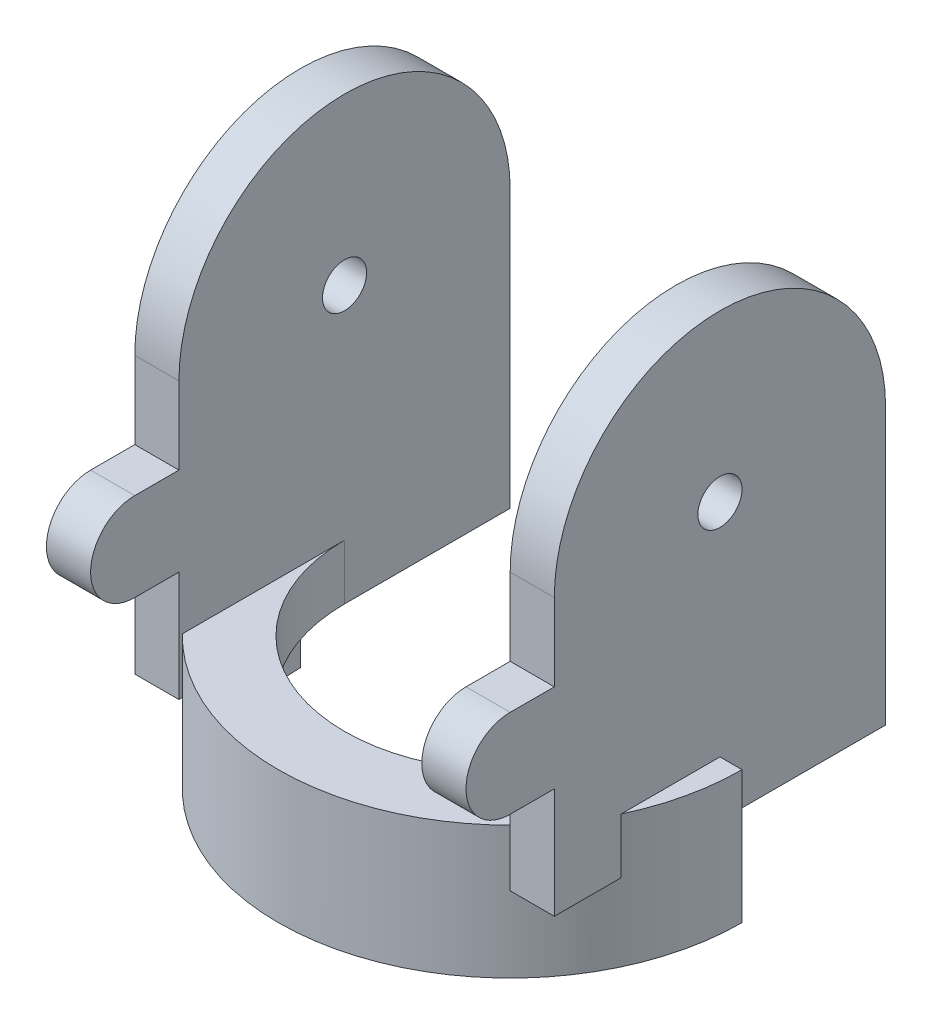
ISO-10303-21;
HEADER;
FILE_DESCRIPTION(('STEP AP214'),'2;1');
FILE_NAME('part.step','',(''),(''),'','','');
FILE_SCHEMA(('AUTOMOTIVE_DESIGN { 1 0 10303 214 1 1 1 1 }'));
ENDSEC;
DATA;
#1=APPLICATION_CONTEXT('core data for automotive mechanical design processes');
#2=APPLICATION_PROTOCOL_DEFINITION('international standard','automotive_design',2000,#1);
#3=PRODUCT_CONTEXT('',#1,'mechanical');
#4=PRODUCT('Part','Part','',(#3));
#5=PRODUCT_RELATED_PRODUCT_CATEGORY('part','',(#4));
#6=PRODUCT_DEFINITION_FORMATION('','',#4);
#7=PRODUCT_DEFINITION_CONTEXT('part definition',#1,'design');
#8=PRODUCT_DEFINITION('design','',#6,#7);
#9=PRODUCT_DEFINITION_SHAPE('','',#8);
#10=(LENGTH_UNIT() NAMED_UNIT(*) SI_UNIT(.MILLI.,.METRE.));
#11=(NAMED_UNIT(*) PLANE_ANGLE_UNIT() SI_UNIT($,.RADIAN.));
#12=(NAMED_UNIT(*) SI_UNIT($,.STERADIAN.) SOLID_ANGLE_UNIT());
#13=UNCERTAINTY_MEASURE_WITH_UNIT(LENGTH_MEASURE(1.E-05),#10,'distance_accuracy_value','');
#14=(GEOMETRIC_REPRESENTATION_CONTEXT(3) GLOBAL_UNCERTAINTY_ASSIGNED_CONTEXT((#13)) GLOBAL_UNIT_ASSIGNED_CONTEXT((#10,
#11,#12)) REPRESENTATION_CONTEXT('',''));
#15=CARTESIAN_POINT('',(0.,0.,0.));
#16=DIRECTION('',(0.,0.,1.));
#17=DIRECTION('',(1.,0.,0.));
#18=AXIS2_PLACEMENT_3D('',#15,#16,#17);
#19=CARTESIAN_POINT('',(-30.,36.,46.));
#20=DIRECTION('',(0.,-1.,0.));
#21=DIRECTION('',(0.,0.,-1.));
#22=AXIS2_PLACEMENT_3D('',#19,#20,#21);
#23=PLANE('',#22);
#24=DIRECTION('',(1.,0.,0.));
#25=VECTOR('',#24,1.);
#26=CARTESIAN_POINT('',(-42.,36.,38.));
#27=LINE('',#26,#25);
#28=CARTESIAN_POINT('',(-38.,36.,38.));
#29=VERTEX_POINT('',#28);
#30=CARTESIAN_POINT('',(-30.,36.,38.));
#31=VERTEX_POINT('',#30);
#32=EDGE_CURVE('E231',#29,#31,#27,.T.);
#33=ORIENTED_EDGE('',*,*,#32,.T.);
#34=DIRECTION('',(0.,0.,-1.));
#35=VECTOR('',#34,1.);
#36=CARTESIAN_POINT('',(-30.,36.,46.));
#37=LINE('',#36,#35);
#38=CARTESIAN_POINT('',(-30.,36.,30.));
#39=VERTEX_POINT('',#38);
#40=EDGE_CURVE('E256',#31,#39,#37,.T.);
#41=ORIENTED_EDGE('',*,*,#40,.T.);
#42=DIRECTION('',(-1.,0.,0.));
#43=VECTOR('',#42,1.);
#44=CARTESIAN_POINT('',(-30.,36.,30.));
#45=LINE('',#44,#43);
#46=CARTESIAN_POINT('',(-38.,36.,30.));
#47=VERTEX_POINT('',#46);
#48=EDGE_CURVE('E239',#39,#47,#45,.T.);
#49=ORIENTED_EDGE('',*,*,#48,.T.);
#50=DIRECTION('',(0.,0.,-1.));
#51=VECTOR('',#50,1.);
#52=CARTESIAN_POINT('',(-38.,36.,46.));
#53=LINE('',#52,#51);
#54=EDGE_CURVE('E254',#29,#47,#53,.T.);
#55=ORIENTED_EDGE('',*,*,#54,.F.);
#56=EDGE_LOOP('',(#33,#41,#49,#55));
#57=FACE_BOUND('',#56,.T.);
#58=ADVANCED_FACE('F38',(#57),#23,.F.);
#59=CARTESIAN_POINT('',(38.,36.,46.));
#60=DIRECTION('',(0.,-1.,0.));
#61=DIRECTION('',(0.,0.,-1.));
#62=AXIS2_PLACEMENT_3D('',#59,#60,#61);
#63=PLANE('',#62);
#64=CARTESIAN_POINT('',(30.,36.,38.));
#65=VERTEX_POINT('',#64);
#66=CARTESIAN_POINT('',(38.,36.,38.));
#67=VERTEX_POINT('',#66);
#68=EDGE_CURVE('E218',#65,#67,#27,.T.);
#69=ORIENTED_EDGE('',*,*,#68,.T.);
#70=DIRECTION('',(0.,0.,-1.));
#71=VECTOR('',#70,1.);
#72=CARTESIAN_POINT('',(38.,36.,46.));
#73=LINE('',#72,#71);
#74=CARTESIAN_POINT('',(38.,36.,30.));
#75=VERTEX_POINT('',#74);
#76=EDGE_CURVE('E228',#67,#75,#73,.T.);
#77=ORIENTED_EDGE('',*,*,#76,.T.);
#78=DIRECTION('',(-1.,0.,0.));
#79=VECTOR('',#78,1.);
#80=CARTESIAN_POINT('',(38.,36.,30.));
#81=LINE('',#80,#79);
#82=CARTESIAN_POINT('',(30.,36.,30.));
#83=VERTEX_POINT('',#82);
#84=EDGE_CURVE('E515',#75,#83,#81,.T.);
#85=ORIENTED_EDGE('',*,*,#84,.T.);
#86=DIRECTION('',(0.,0.,-1.));
#87=VECTOR('',#86,1.);
#88=CARTESIAN_POINT('',(30.,36.,46.));
#89=LINE('',#88,#87);
#90=EDGE_CURVE('E230',#65,#83,#89,.T.);
#91=ORIENTED_EDGE('',*,*,#90,.F.);
#92=EDGE_LOOP('',(#69,#77,#85,#91));
#93=FACE_BOUND('',#92,.T.);
#94=ADVANCED_FACE('F226',(#93),#63,.F.);
#95=CARTESIAN_POINT('',(38.,80.,30.));
#96=DIRECTION('',(0.,0.,1.));
#97=DIRECTION('',(1.,0.,0.));
#98=AXIS2_PLACEMENT_3D('',#95,#96,#97);
#99=PLANE('',#98);
#100=DIRECTION('',(0.,-1.,0.));
#101=VECTOR('',#100,1.);
#102=CARTESIAN_POINT('',(30.,80.,30.));
#103=LINE('',#102,#101);
#104=CARTESIAN_POINT('',(30.,50.,30.));
#105=VERTEX_POINT('',#104);
#106=EDGE_CURVE('E361',#105,#83,#103,.T.);
#107=ORIENTED_EDGE('',*,*,#106,.T.);
#108=ORIENTED_EDGE('',*,*,#84,.F.);
#109=DIRECTION('',(0.,-1.,0.));
#110=VECTOR('',#109,1.);
#111=CARTESIAN_POINT('',(38.,80.,30.));
#112=LINE('',#111,#110);
#113=CARTESIAN_POINT('',(38.,50.,30.));
#114=VERTEX_POINT('',#113);
#115=EDGE_CURVE('E238',#114,#75,#112,.T.);
#116=ORIENTED_EDGE('',*,*,#115,.F.);
#117=DIRECTION('',(1.,0.,0.));
#118=VECTOR('',#117,1.);
#119=CARTESIAN_POINT('',(-42.,50.,30.));
#120=LINE('',#119,#118);
#121=EDGE_CURVE('E317',#105,#114,#120,.T.);
#122=ORIENTED_EDGE('',*,*,#121,.F.);
#123=EDGE_LOOP('',(#107,#108,#116,#122));
#124=FACE_BOUND('',#123,.T.);
#125=ADVANCED_FACE('F532',(#124),#99,.T.);
#126=CARTESIAN_POINT('',(38.,20.,30.));
#127=VERTEX_POINT('',#126);
#128=CARTESIAN_POINT('',(38.,0.,30.));
#129=VERTEX_POINT('',#128);
#130=EDGE_CURVE('E355',#127,#129,#112,.T.);
#131=ORIENTED_EDGE('',*,*,#130,.F.);
#132=DIRECTION('',(1.,0.,0.));
#133=VECTOR('',#132,1.);
#134=CARTESIAN_POINT('',(38.,20.,30.));
#135=LINE('',#134,#133);
#136=CARTESIAN_POINT('',(30.,20.,30.));
#137=VERTEX_POINT('',#136);
#138=EDGE_CURVE('E509',#137,#127,#135,.T.);
#139=ORIENTED_EDGE('',*,*,#138,.F.);
#140=CARTESIAN_POINT('',(30.,0.,30.));
#141=VERTEX_POINT('',#140);
#142=EDGE_CURVE('E364',#137,#141,#103,.T.);
#143=ORIENTED_EDGE('',*,*,#142,.T.);
#144=DIRECTION('',(-1.,0.,0.));
#145=VECTOR('',#144,1.);
#146=CARTESIAN_POINT('',(38.,0.,30.));
#147=LINE('',#146,#145);
#148=EDGE_CURVE('E345',#129,#141,#147,.T.);
#149=ORIENTED_EDGE('',*,*,#148,.F.);
#150=EDGE_LOOP('',(#131,#139,#143,#149));
#151=FACE_BOUND('',#150,.T.);
#152=ADVANCED_FACE('F506',(#151),#99,.T.);
#153=CARTESIAN_POINT('',(-38.,80.,30.));
#154=DIRECTION('',(0.,0.,1.));
#155=DIRECTION('',(1.,0.,0.));
#156=AXIS2_PLACEMENT_3D('',#153,#154,#155);
#157=PLANE('',#156);
#158=DIRECTION('',(0.,-1.,0.));
#159=VECTOR('',#158,1.);
#160=CARTESIAN_POINT('',(-38.,80.,30.));
#161=LINE('',#160,#159);
#162=CARTESIAN_POINT('',(-38.,50.,30.));
#163=VERTEX_POINT('',#162);
#164=EDGE_CURVE('E381',#163,#47,#161,.T.);
#165=ORIENTED_EDGE('',*,*,#164,.T.);
#166=ORIENTED_EDGE('',*,*,#48,.F.);
#167=DIRECTION('',(0.,-1.,0.));
#168=VECTOR('',#167,1.);
#169=CARTESIAN_POINT('',(-30.,80.,30.));
#170=LINE('',#169,#168);
#171=CARTESIAN_POINT('',(-30.,50.,30.));
#172=VERTEX_POINT('',#171);
#173=EDGE_CURVE('E386',#172,#39,#170,.T.);
#174=ORIENTED_EDGE('',*,*,#173,.F.);
#175=EDGE_CURVE('E319',#163,#172,#120,.T.);
#176=ORIENTED_EDGE('',*,*,#175,.F.);
#177=EDGE_LOOP('',(#165,#166,#174,#176));
#178=FACE_BOUND('',#177,.T.);
#179=ADVANCED_FACE('F473',(#178),#157,.T.);
#180=CARTESIAN_POINT('',(-30.,20.,30.));
#181=VERTEX_POINT('',#180);
#182=CARTESIAN_POINT('',(-30.,0.,30.));
#183=VERTEX_POINT('',#182);
#184=EDGE_CURVE('E389',#181,#183,#170,.T.);
#185=ORIENTED_EDGE('',*,*,#184,.F.);
#186=DIRECTION('',(1.,0.,0.));
#187=VECTOR('',#186,1.);
#188=CARTESIAN_POINT('',(-30.,20.,30.));
#189=LINE('',#188,#187);
#190=CARTESIAN_POINT('',(-38.,20.,30.));
#191=VERTEX_POINT('',#190);
#192=EDGE_CURVE('E242',#191,#181,#189,.T.);
#193=ORIENTED_EDGE('',*,*,#192,.F.);
#194=CARTESIAN_POINT('',(-38.,0.,30.));
#195=VERTEX_POINT('',#194);
#196=EDGE_CURVE('E385',#191,#195,#161,.T.);
#197=ORIENTED_EDGE('',*,*,#196,.T.);
#198=DIRECTION('',(-1.,0.,0.));
#199=VECTOR('',#198,1.);
#200=CARTESIAN_POINT('',(-38.,0.,30.));
#201=LINE('',#200,#199);
#202=EDGE_CURVE('E377',#183,#195,#201,.T.);
#203=ORIENTED_EDGE('',*,*,#202,.F.);
#204=EDGE_LOOP('',(#185,#193,#197,#203));
#205=FACE_BOUND('',#204,.T.);
#206=ADVANCED_FACE('F458',(#205),#157,.T.);
#207=CARTESIAN_POINT('',(0.,0.,0.));
#208=DIRECTION('',(0.,1.,0.));
#209=DIRECTION('',(0.,0.,1.));
#210=AXIS2_PLACEMENT_3D('',#207,#208,#209);
#211=PLANE('',#210);
#212=DIRECTION('',(0.,0.,-1.));
#213=VECTOR('',#212,1.);
#214=CARTESIAN_POINT('',(-38.,0.,30.));
#215=LINE('',#214,#213);
#216=CARTESIAN_POINT('',(-38.,0.,17.8885438199983));
#217=VERTEX_POINT('',#216);
#218=EDGE_CURVE('E368',#195,#217,#215,.T.);
#219=ORIENTED_EDGE('',*,*,#218,.T.);
#220=CARTESIAN_POINT('',(0.,0.,0.));
#221=DIRECTION('',(0.,1.,0.));
#222=DIRECTION('',(0.,0.,1.));
#223=AXIS2_PLACEMENT_3D('',#220,#221,#222);
#224=CIRCLE('',#223,42.);
#225=CARTESIAN_POINT('',(-30.,0.,29.3938769133981));
#226=VERTEX_POINT('',#225);
#227=EDGE_CURVE('E299',#217,#226,#224,.T.);
#228=ORIENTED_EDGE('',*,*,#227,.T.);
#229=DIRECTION('',(0.,0.,1.));
#230=VECTOR('',#229,1.);
#231=CARTESIAN_POINT('',(-30.,0.,30.));
#232=LINE('',#231,#230);
#233=EDGE_CURVE('E374',#226,#183,#232,.T.);
#234=ORIENTED_EDGE('',*,*,#233,.T.);
#235=ORIENTED_EDGE('',*,*,#202,.T.);
#236=EDGE_LOOP('',(#219,#228,#234,#235));
#237=FACE_BOUND('',#236,.T.);
#238=ADVANCED_FACE('F448',(#237),#211,.F.);
#239=DIRECTION('',(0.,0.,-1.));
#240=VECTOR('',#239,1.);
#241=CARTESIAN_POINT('',(30.,0.,30.));
#242=LINE('',#241,#240);
#243=CARTESIAN_POINT('',(30.,0.,29.3938769133982));
#244=VERTEX_POINT('',#243);
#245=EDGE_CURVE('E349',#141,#244,#242,.T.);
#246=ORIENTED_EDGE('',*,*,#245,.T.);
#247=CARTESIAN_POINT('',(38.,0.,17.8885438199984));
#248=VERTEX_POINT('',#247);
#249=EDGE_CURVE('E296',#244,#248,#224,.T.);
#250=ORIENTED_EDGE('',*,*,#249,.T.);
#251=DIRECTION('',(0.,0.,1.));
#252=VECTOR('',#251,1.);
#253=CARTESIAN_POINT('',(38.,0.,30.));
#254=LINE('',#253,#252);
#255=EDGE_CURVE('E341',#248,#129,#254,.T.);
#256=ORIENTED_EDGE('',*,*,#255,.T.);
#257=ORIENTED_EDGE('',*,*,#148,.T.);
#258=EDGE_LOOP('',(#246,#250,#256,#257));
#259=FACE_BOUND('',#258,.T.);
#260=ADVANCED_FACE('F500',(#259),#211,.F.);
#261=CARTESIAN_POINT('',(0.,10.,0.));
#262=DIRECTION('',(0.,1.,0.));
#263=DIRECTION('',(0.,0.,1.));
#264=AXIS2_PLACEMENT_3D('',#261,#262,#263);
#265=PLANE('',#264);
#266=DIRECTION('',(0.,0.,1.));
#267=VECTOR('',#266,1.);
#268=CARTESIAN_POINT('',(30.,10.,0.));
#269=LINE('',#268,#267);
#270=CARTESIAN_POINT('',(30.,9.99999999999999,0.));
#271=VERTEX_POINT('',#270);
#272=CARTESIAN_POINT('',(30.,10.,29.3938769133982));
#273=VERTEX_POINT('',#272);
#274=EDGE_CURVE('E358',#271,#273,#269,.T.);
#275=ORIENTED_EDGE('',*,*,#274,.F.);
#276=CARTESIAN_POINT('',(0.,10.,0.));
#277=DIRECTION('',(0.,1.,0.));
#278=DIRECTION('',(0.,0.,1.));
#279=AXIS2_PLACEMENT_3D('',#276,#277,#278);
#280=CIRCLE('',#279,30.);
#281=CARTESIAN_POINT('',(-30.,10.,0.));
#282=VERTEX_POINT('',#281);
#283=EDGE_CURVE('E397',#282,#271,#280,.T.);
#284=ORIENTED_EDGE('',*,*,#283,.F.);
#285=DIRECTION('',(0.,0.,-1.));
#286=VECTOR('',#285,1.);
#287=CARTESIAN_POINT('',(-30.,10.,0.));
#288=LINE('',#287,#286);
#289=CARTESIAN_POINT('',(-30.,10.,29.3938769133981));
#290=VERTEX_POINT('',#289);
#291=EDGE_CURVE('E384',#290,#282,#288,.T.);
#292=ORIENTED_EDGE('',*,*,#291,.F.);
#293=CARTESIAN_POINT('',(0.,10.,0.));
#294=DIRECTION('',(0.,1.,0.));
#295=DIRECTION('',(0.,0.,1.));
#296=AXIS2_PLACEMENT_3D('',#293,#294,#295);
#297=CIRCLE('',#296,42.);
#298=EDGE_CURVE('E277',#290,#273,#297,.T.);
#299=ORIENTED_EDGE('',*,*,#298,.T.);
#300=EDGE_LOOP('',(#275,#284,#292,#299));
#301=FACE_BOUND('',#300,.T.);
#302=ADVANCED_FACE('F495',(#301),#265,.T.);
#303=CARTESIAN_POINT('',(0.,0.,0.));
#304=DIRECTION('',(0.,1.,0.));
#305=DIRECTION('',(0.,0.,1.));
#306=AXIS2_PLACEMENT_3D('',#303,#304,#305);
#307=CIRCLE('',#306,38.);
#308=CARTESIAN_POINT('',(-38.,0.,0.));
#309=VERTEX_POINT('',#308);
#310=CARTESIAN_POINT('',(38.,0.,0.));
#311=VERTEX_POINT('',#310);
#312=EDGE_CURVE('E400',#309,#311,#307,.T.);
#313=ORIENTED_EDGE('',*,*,#312,.F.);
#314=CARTESIAN_POINT('',(-38.,0.,-30.));
#315=VERTEX_POINT('',#314);
#316=EDGE_CURVE('E367',#309,#315,#215,.T.);
#317=ORIENTED_EDGE('',*,*,#316,.T.);
#318=DIRECTION('',(1.,0.,0.));
#319=VECTOR('',#318,1.);
#320=CARTESIAN_POINT('',(-38.,0.,-30.));
#321=LINE('',#320,#319);
#322=CARTESIAN_POINT('',(-30.,0.,-30.));
#323=VERTEX_POINT('',#322);
#324=EDGE_CURVE('E371',#315,#323,#321,.T.);
#325=ORIENTED_EDGE('',*,*,#324,.T.);
#326=CARTESIAN_POINT('',(-30.,0.,0.));
#327=VERTEX_POINT('',#326);
#328=EDGE_CURVE('E375',#323,#327,#232,.T.);
#329=ORIENTED_EDGE('',*,*,#328,.T.);
#330=CARTESIAN_POINT('',(0.,0.,0.));
#331=DIRECTION('',(0.,1.,0.));
#332=DIRECTION('',(0.,0.,1.));
#333=AXIS2_PLACEMENT_3D('',#330,#331,#332);
#334=CIRCLE('',#333,30.);
#335=CARTESIAN_POINT('',(30.,0.,0.));
#336=VERTEX_POINT('',#335);
#337=EDGE_CURVE('E396',#327,#336,#334,.T.);
#338=ORIENTED_EDGE('',*,*,#337,.T.);
#339=CARTESIAN_POINT('',(30.,0.,-30.));
#340=VERTEX_POINT('',#339);
#341=EDGE_CURVE('E348',#336,#340,#242,.T.);
#342=ORIENTED_EDGE('',*,*,#341,.T.);
#343=DIRECTION('',(1.,0.,0.));
#344=VECTOR('',#343,1.);
#345=CARTESIAN_POINT('',(38.,0.,-30.));
#346=LINE('',#345,#344);
#347=CARTESIAN_POINT('',(38.,0.,-30.));
#348=VERTEX_POINT('',#347);
#349=EDGE_CURVE('E352',#340,#348,#346,.T.);
#350=ORIENTED_EDGE('',*,*,#349,.T.);
#351=EDGE_CURVE('E342',#348,#311,#254,.T.);
#352=ORIENTED_EDGE('',*,*,#351,.T.);
#353=EDGE_LOOP('',(#313,#317,#325,#329,#338,#342,#350,#352));
#354=FACE_BOUND('',#353,.T.);
#355=ADVANCED_FACE('F40',(#354),#211,.F.);
#356=CARTESIAN_POINT('',(0.,10.,0.));
#357=DIRECTION('',(0.,-1.,0.));
#358=DIRECTION('',(0.,0.,-1.));
#359=AXIS2_PLACEMENT_3D('',#356,#357,#358);
#360=CYLINDRICAL_SURFACE('',#359,30.);
#361=DIRECTION('',(0.,-1.,0.));
#362=VECTOR('',#361,1.);
#363=CARTESIAN_POINT('',(-30.,80.,0.));
#364=LINE('',#363,#362);
#365=EDGE_CURVE('E309',#282,#327,#364,.T.);
#366=ORIENTED_EDGE('',*,*,#365,.F.);
#367=ORIENTED_EDGE('',*,*,#283,.T.);
#368=DIRECTION('',(0.,-1.,0.));
#369=VECTOR('',#368,1.);
#370=CARTESIAN_POINT('',(30.,80.,0.));
#371=LINE('',#370,#369);
#372=EDGE_CURVE('E308',#271,#336,#371,.T.);
#373=ORIENTED_EDGE('',*,*,#372,.T.);
#374=ORIENTED_EDGE('',*,*,#337,.F.);
#375=EDGE_LOOP('',(#366,#367,#373,#374));
#376=FACE_BOUND('',#375,.T.);
#377=ADVANCED_FACE('F487',(#376),#360,.F.);
#378=CARTESIAN_POINT('',(-30.,80.,30.));
#379=DIRECTION('',(1.,0.,0.));
#380=DIRECTION('',(0.,0.,-1.));
#381=AXIS2_PLACEMENT_3D('',#378,#379,#380);
#382=PLANE('',#381);
#383=CARTESIAN_POINT('',(-30.,28.,38.));
#384=DIRECTION('',(1.,0.,0.));
#385=DIRECTION('',(0.,0.,-1.));
#386=AXIS2_PLACEMENT_3D('',#383,#384,#385);
#387=CIRCLE('',#386,8.);
#388=CARTESIAN_POINT('',(-30.,20.,38.));
#389=VERTEX_POINT('',#388);
#390=EDGE_CURVE('E465',#389,#31,#387,.F.);
#391=ORIENTED_EDGE('',*,*,#390,.F.);
#392=DIRECTION('',(0.,0.,-1.));
#393=VECTOR('',#392,1.);
#394=CARTESIAN_POINT('',(-30.,20.,46.));
#395=LINE('',#394,#393);
#396=EDGE_CURVE('E250',#389,#181,#395,.T.);
#397=ORIENTED_EDGE('',*,*,#396,.T.);
#398=ORIENTED_EDGE('',*,*,#184,.T.);
#399=ORIENTED_EDGE('',*,*,#233,.F.);
#400=DIRECTION('',(0.,1.,0.));
#401=VECTOR('',#400,1.);
#402=CARTESIAN_POINT('',(-30.,-14.,29.3938769133981));
#403=LINE('',#402,#401);
#404=EDGE_CURVE('E305',#290,#226,#403,.F.);
#405=ORIENTED_EDGE('',*,*,#404,.F.);
#406=ORIENTED_EDGE('',*,*,#291,.T.);
#407=ORIENTED_EDGE('',*,*,#365,.T.);
#408=ORIENTED_EDGE('',*,*,#328,.F.);
#409=DIRECTION('',(0.,-1.,0.));
#410=VECTOR('',#409,1.);
#411=CARTESIAN_POINT('',(-30.,80.,-30.));
#412=LINE('',#411,#410);
#413=CARTESIAN_POINT('',(-30.,50.,-30.));
#414=VERTEX_POINT('',#413);
#415=EDGE_CURVE('E390',#414,#323,#412,.T.);
#416=ORIENTED_EDGE('',*,*,#415,.F.);
#417=CARTESIAN_POINT('',(-30.,50.,0.));
#418=DIRECTION('',(1.,0.,0.));
#419=DIRECTION('',(0.,0.,-1.));
#420=AXIS2_PLACEMENT_3D('',#417,#418,#419);
#421=CIRCLE('',#420,30.);
#422=EDGE_CURVE('E330',#172,#414,#421,.F.);
#423=ORIENTED_EDGE('',*,*,#422,.F.);
#424=ORIENTED_EDGE('',*,*,#173,.T.);
#425=ORIENTED_EDGE('',*,*,#40,.F.);
#426=EDGE_LOOP('',(#391,#397,#398,#399,#405,#406,#407,#408,#416,#423,#424,#425));
#427=FACE_BOUND('',#426,.T.);
#428=CARTESIAN_POINT('',(-30.,50.,0.));
#429=DIRECTION('',(1.,0.,0.));
#430=DIRECTION('',(0.,0.,-1.));
#431=AXIS2_PLACEMENT_3D('',#428,#429,#430);
#432=CIRCLE('',#431,4.);
#433=CARTESIAN_POINT('',(-30.,50.,-4.00000000000002));
#434=VERTEX_POINT('',#433);
#435=EDGE_CURVE('E338',#434,#434,#432,.T.);
#436=ORIENTED_EDGE('',*,*,#435,.F.);
#437=EDGE_LOOP('',(#436));
#438=FACE_BOUND('',#437,.T.);
#439=ADVANCED_FACE('F452',(#427,#438),#382,.T.);
#440=CARTESIAN_POINT('',(-38.,80.,30.));
#441=DIRECTION('',(-1.,0.,0.));
#442=DIRECTION('',(0.,0.,1.));
#443=AXIS2_PLACEMENT_3D('',#440,#441,#442);
#444=PLANE('',#443);
#445=DIRECTION('',(0.,0.,-1.));
#446=VECTOR('',#445,1.);
#447=CARTESIAN_POINT('',(-38.,20.,46.));
#448=LINE('',#447,#446);
#449=CARTESIAN_POINT('',(-38.,20.,38.));
#450=VERTEX_POINT('',#449);
#451=EDGE_CURVE('E252',#450,#191,#448,.T.);
#452=ORIENTED_EDGE('',*,*,#451,.F.);
#453=CARTESIAN_POINT('',(-38.,28.,38.));
#454=DIRECTION('',(-1.,0.,0.));
#455=DIRECTION('',(0.,0.,1.));
#456=AXIS2_PLACEMENT_3D('',#453,#454,#455);
#457=CIRCLE('',#456,8.);
#458=EDGE_CURVE('E53',#29,#450,#457,.F.);
#459=ORIENTED_EDGE('',*,*,#458,.F.);
#460=ORIENTED_EDGE('',*,*,#54,.T.);
#461=ORIENTED_EDGE('',*,*,#164,.F.);
#462=CARTESIAN_POINT('',(-38.,50.,0.));
#463=DIRECTION('',(-1.,0.,0.));
#464=DIRECTION('',(0.,0.,1.));
#465=AXIS2_PLACEMENT_3D('',#462,#463,#464);
#466=CIRCLE('',#465,30.);
#467=CARTESIAN_POINT('',(-38.,50.,-30.));
#468=VERTEX_POINT('',#467);
#469=EDGE_CURVE('E328',#468,#163,#466,.F.);
#470=ORIENTED_EDGE('',*,*,#469,.F.);
#471=DIRECTION('',(0.,-1.,0.));
#472=VECTOR('',#471,1.);
#473=CARTESIAN_POINT('',(-38.,80.,-30.));
#474=LINE('',#473,#472);
#475=EDGE_CURVE('E380',#468,#315,#474,.T.);
#476=ORIENTED_EDGE('',*,*,#475,.T.);
#477=ORIENTED_EDGE('',*,*,#316,.F.);
#478=DIRECTION('',(0.,1.,0.));
#479=VECTOR('',#478,1.);
#480=CARTESIAN_POINT('',(-38.,-14.,0.));
#481=LINE('',#480,#479);
#482=CARTESIAN_POINT('',(-38.,9.99999999999999,0.));
#483=VERTEX_POINT('',#482);
#484=EDGE_CURVE('E288',#309,#483,#481,.T.);
#485=ORIENTED_EDGE('',*,*,#484,.T.);
#486=DIRECTION('',(0.,0.,-1.));
#487=VECTOR('',#486,1.);
#488=CARTESIAN_POINT('',(-38.,9.99999999999999,30.));
#489=LINE('',#488,#487);
#490=CARTESIAN_POINT('',(-38.,10.,17.8885438199983));
#491=VERTEX_POINT('',#490);
#492=EDGE_CURVE('E284',#491,#483,#489,.T.);
#493=ORIENTED_EDGE('',*,*,#492,.F.);
#494=DIRECTION('',(0.,1.,0.));
#495=VECTOR('',#494,1.);
#496=CARTESIAN_POINT('',(-38.,-14.,17.8885438199983));
#497=LINE('',#496,#495);
#498=EDGE_CURVE('E302',#217,#491,#497,.T.);
#499=ORIENTED_EDGE('',*,*,#498,.F.);
#500=ORIENTED_EDGE('',*,*,#218,.F.);
#501=ORIENTED_EDGE('',*,*,#196,.F.);
#502=EDGE_LOOP('',(#452,#459,#460,#461,#470,#476,#477,#485,#493,#499,#500,#501));
#503=FACE_BOUND('',#502,.T.);
#504=CARTESIAN_POINT('',(-38.,50.,0.));
#505=DIRECTION('',(-1.,0.,0.));
#506=DIRECTION('',(0.,0.,1.));
#507=AXIS2_PLACEMENT_3D('',#504,#505,#506);
#508=CIRCLE('',#507,4.);
#509=CARTESIAN_POINT('',(-38.,50.,3.99999999999998));
#510=VERTEX_POINT('',#509);
#511=EDGE_CURVE('E335',#510,#510,#508,.T.);
#512=ORIENTED_EDGE('',*,*,#511,.F.);
#513=EDGE_LOOP('',(#512));
#514=FACE_BOUND('',#513,.T.);
#515=ADVANCED_FACE('F431',(#503,#514),#444,.T.);
#516=CARTESIAN_POINT('',(-38.,80.,-30.));
#517=DIRECTION('',(0.,0.,-1.));
#518=DIRECTION('',(-1.,0.,0.));
#519=AXIS2_PLACEMENT_3D('',#516,#517,#518);
#520=PLANE('',#519);
#521=DIRECTION('',(1.,0.,0.));
#522=VECTOR('',#521,1.);
#523=CARTESIAN_POINT('',(-42.,50.,-30.));
#524=LINE('',#523,#522);
#525=EDGE_CURVE('E320',#468,#414,#524,.T.);
#526=ORIENTED_EDGE('',*,*,#525,.T.);
#527=ORIENTED_EDGE('',*,*,#415,.T.);
#528=ORIENTED_EDGE('',*,*,#324,.F.);
#529=ORIENTED_EDGE('',*,*,#475,.F.);
#530=EDGE_LOOP('',(#526,#527,#528,#529));
#531=FACE_BOUND('',#530,.T.);
#532=ADVANCED_FACE('F482',(#531),#520,.T.);
#533=CARTESIAN_POINT('',(30.,80.,30.));
#534=DIRECTION('',(-1.,0.,0.));
#535=DIRECTION('',(0.,0.,1.));
#536=AXIS2_PLACEMENT_3D('',#533,#534,#535);
#537=PLANE('',#536);
#538=DIRECTION('',(0.,0.,-1.));
#539=VECTOR('',#538,1.);
#540=CARTESIAN_POINT('',(30.,20.,46.));
#541=LINE('',#540,#539);
#542=CARTESIAN_POINT('',(30.,20.,38.));
#543=VERTEX_POINT('',#542);
#544=EDGE_CURVE('E244',#543,#137,#541,.T.);
#545=ORIENTED_EDGE('',*,*,#544,.F.);
#546=CARTESIAN_POINT('',(30.,28.,38.));
#547=DIRECTION('',(-1.,0.,0.));
#548=DIRECTION('',(0.,0.,1.));
#549=AXIS2_PLACEMENT_3D('',#546,#547,#548);
#550=CIRCLE('',#549,8.);
#551=EDGE_CURVE('E61',#65,#543,#550,.F.);
#552=ORIENTED_EDGE('',*,*,#551,.F.);
#553=ORIENTED_EDGE('',*,*,#90,.T.);
#554=ORIENTED_EDGE('',*,*,#106,.F.);
#555=CARTESIAN_POINT('',(30.,50.,0.));
#556=DIRECTION('',(-1.,0.,0.));
#557=DIRECTION('',(0.,0.,1.));
#558=AXIS2_PLACEMENT_3D('',#555,#556,#557);
#559=CIRCLE('',#558,30.);
#560=CARTESIAN_POINT('',(30.,50.,-30.));
#561=VERTEX_POINT('',#560);
#562=EDGE_CURVE('E326',#561,#105,#559,.F.);
#563=ORIENTED_EDGE('',*,*,#562,.F.);
#564=DIRECTION('',(0.,-1.,0.));
#565=VECTOR('',#564,1.);
#566=CARTESIAN_POINT('',(30.,80.,-30.));
#567=LINE('',#566,#565);
#568=EDGE_CURVE('E359',#561,#340,#567,.T.);
#569=ORIENTED_EDGE('',*,*,#568,.T.);
#570=ORIENTED_EDGE('',*,*,#341,.F.);
#571=ORIENTED_EDGE('',*,*,#372,.F.);
#572=ORIENTED_EDGE('',*,*,#274,.T.);
#573=DIRECTION('',(0.,1.,0.));
#574=VECTOR('',#573,1.);
#575=CARTESIAN_POINT('',(30.,-14.,29.3938769133982));
#576=LINE('',#575,#574);
#577=EDGE_CURVE('E298',#244,#273,#576,.T.);
#578=ORIENTED_EDGE('',*,*,#577,.F.);
#579=ORIENTED_EDGE('',*,*,#245,.F.);
#580=ORIENTED_EDGE('',*,*,#142,.F.);
#581=EDGE_LOOP('',(#545,#552,#553,#554,#563,#569,#570,#571,#572,#578,#579,#580));
#582=FACE_BOUND('',#581,.T.);
#583=CARTESIAN_POINT('',(30.,50.,0.));
#584=DIRECTION('',(-1.,0.,0.));
#585=DIRECTION('',(0.,0.,1.));
#586=AXIS2_PLACEMENT_3D('',#583,#584,#585);
#587=CIRCLE('',#586,4.);
#588=CARTESIAN_POINT('',(30.,50.,4.));
#589=VERTEX_POINT('',#588);
#590=EDGE_CURVE('E332',#589,#589,#587,.T.);
#591=ORIENTED_EDGE('',*,*,#590,.F.);
#592=EDGE_LOOP('',(#591));
#593=FACE_BOUND('',#592,.T.);
#594=ADVANCED_FACE('F491',(#582,#593),#537,.T.);
#595=CARTESIAN_POINT('',(38.,80.,30.));
#596=DIRECTION('',(1.,0.,0.));
#597=DIRECTION('',(0.,0.,-1.));
#598=AXIS2_PLACEMENT_3D('',#595,#596,#597);
#599=PLANE('',#598);
#600=CARTESIAN_POINT('',(38.,28.,38.));
#601=DIRECTION('',(-1.,0.,0.));
#602=DIRECTION('',(0.,0.,-1.));
#603=AXIS2_PLACEMENT_3D('',#600,#601,#602);
#604=CIRCLE('',#603,8.);
#605=CARTESIAN_POINT('',(38.,20.,38.));
#606=VERTEX_POINT('',#605);
#607=EDGE_CURVE('E215',#606,#67,#604,.T.);
#608=ORIENTED_EDGE('',*,*,#607,.F.);
#609=DIRECTION('',(0.,0.,-1.));
#610=VECTOR('',#609,1.);
#611=CARTESIAN_POINT('',(38.,20.,46.));
#612=LINE('',#611,#610);
#613=EDGE_CURVE('E511',#606,#127,#612,.T.);
#614=ORIENTED_EDGE('',*,*,#613,.T.);
#615=ORIENTED_EDGE('',*,*,#130,.T.);
#616=ORIENTED_EDGE('',*,*,#255,.F.);
#617=DIRECTION('',(0.,1.,0.));
#618=VECTOR('',#617,1.);
#619=CARTESIAN_POINT('',(38.,-14.,17.8885438199984));
#620=LINE('',#619,#618);
#621=CARTESIAN_POINT('',(38.,10.,17.8885438199984));
#622=VERTEX_POINT('',#621);
#623=EDGE_CURVE('E11',#622,#248,#620,.F.);
#624=ORIENTED_EDGE('',*,*,#623,.F.);
#625=DIRECTION('',(0.,0.,1.));
#626=VECTOR('',#625,1.);
#627=CARTESIAN_POINT('',(38.,9.99999999999999,30.));
#628=LINE('',#627,#626);
#629=CARTESIAN_POINT('',(38.,9.99999999999999,0.));
#630=VERTEX_POINT('',#629);
#631=EDGE_CURVE('E404',#630,#622,#628,.T.);
#632=ORIENTED_EDGE('',*,*,#631,.F.);
#633=DIRECTION('',(0.,1.,0.));
#634=VECTOR('',#633,1.);
#635=CARTESIAN_POINT('',(38.,80.,0.));
#636=LINE('',#635,#634);
#637=EDGE_CURVE('E46',#311,#630,#636,.T.);
#638=ORIENTED_EDGE('',*,*,#637,.F.);
#639=ORIENTED_EDGE('',*,*,#351,.F.);
#640=DIRECTION('',(0.,-1.,0.));
#641=VECTOR('',#640,1.);
#642=CARTESIAN_POINT('',(38.,80.,-30.));
#643=LINE('',#642,#641);
#644=CARTESIAN_POINT('',(38.,50.,-30.));
#645=VERTEX_POINT('',#644);
#646=EDGE_CURVE('E356',#645,#348,#643,.T.);
#647=ORIENTED_EDGE('',*,*,#646,.F.);
#648=CARTESIAN_POINT('',(38.,50.,0.));
#649=DIRECTION('',(-1.,0.,0.));
#650=DIRECTION('',(0.,0.,-1.));
#651=AXIS2_PLACEMENT_3D('',#648,#649,#650);
#652=CIRCLE('',#651,30.);
#653=EDGE_CURVE('E312',#114,#645,#652,.T.);
#654=ORIENTED_EDGE('',*,*,#653,.F.);
#655=ORIENTED_EDGE('',*,*,#115,.T.);
#656=ORIENTED_EDGE('',*,*,#76,.F.);
#657=EDGE_LOOP('',(#608,#614,#615,#616,#624,#632,#638,#639,#647,#654,#655,#656));
#658=FACE_BOUND('',#657,.T.);
#659=CARTESIAN_POINT('',(38.,50.,0.));
#660=DIRECTION('',(1.,0.,0.));
#661=DIRECTION('',(0.,0.,-1.));
#662=AXIS2_PLACEMENT_3D('',#659,#660,#661);
#663=CIRCLE('',#662,4.);
#664=CARTESIAN_POINT('',(38.,50.,-4.));
#665=VERTEX_POINT('',#664);
#666=EDGE_CURVE('E323',#665,#665,#663,.T.);
#667=ORIENTED_EDGE('',*,*,#666,.F.);
#668=EDGE_LOOP('',(#667));
#669=FACE_BOUND('',#668,.T.);
#670=ADVANCED_FACE('F234',(#658,#669),#599,.T.);
#671=CARTESIAN_POINT('',(38.,80.,-30.));
#672=DIRECTION('',(0.,0.,-1.));
#673=DIRECTION('',(-1.,0.,0.));
#674=AXIS2_PLACEMENT_3D('',#671,#672,#673);
#675=PLANE('',#674);
#676=EDGE_CURVE('E316',#561,#645,#524,.T.);
#677=ORIENTED_EDGE('',*,*,#676,.T.);
#678=ORIENTED_EDGE('',*,*,#646,.T.);
#679=ORIENTED_EDGE('',*,*,#349,.F.);
#680=ORIENTED_EDGE('',*,*,#568,.F.);
#681=EDGE_LOOP('',(#677,#678,#679,#680));
#682=FACE_BOUND('',#681,.T.);
#683=ADVANCED_FACE('F554',(#682),#675,.T.);
#684=CARTESIAN_POINT('',(-42.,50.,0.));
#685=DIRECTION('',(1.,0.,0.));
#686=DIRECTION('',(0.,0.,-1.));
#687=AXIS2_PLACEMENT_3D('',#684,#685,#686);
#688=CYLINDRICAL_SURFACE('',#687,30.);
#689=ORIENTED_EDGE('',*,*,#562,.T.);
#690=ORIENTED_EDGE('',*,*,#121,.T.);
#691=ORIENTED_EDGE('',*,*,#653,.T.);
#692=ORIENTED_EDGE('',*,*,#676,.F.);
#693=EDGE_LOOP('',(#689,#690,#691,#692));
#694=FACE_BOUND('',#693,.T.);
#695=ADVANCED_FACE('F550',(#694),#688,.T.);
#696=CARTESIAN_POINT('',(-42.,50.,0.));
#697=DIRECTION('',(1.,0.,0.));
#698=DIRECTION('',(0.,0.,-1.));
#699=AXIS2_PLACEMENT_3D('',#696,#697,#698);
#700=CYLINDRICAL_SURFACE('',#699,4.);
#701=ORIENTED_EDGE('',*,*,#590,.T.);
#702=EDGE_LOOP('',(#701));
#703=FACE_BOUND('',#702,.T.);
#704=ORIENTED_EDGE('',*,*,#666,.T.);
#705=EDGE_LOOP('',(#704));
#706=FACE_BOUND('',#705,.T.);
#707=ADVANCED_FACE('F549',(#703,#706),#700,.F.);
#708=ORIENTED_EDGE('',*,*,#422,.T.);
#709=ORIENTED_EDGE('',*,*,#525,.F.);
#710=ORIENTED_EDGE('',*,*,#469,.T.);
#711=ORIENTED_EDGE('',*,*,#175,.T.);
#712=EDGE_LOOP('',(#708,#709,#710,#711));
#713=FACE_BOUND('',#712,.T.);
#714=ADVANCED_FACE('F480',(#713),#688,.T.);
#715=ORIENTED_EDGE('',*,*,#435,.T.);
#716=EDGE_LOOP('',(#715));
#717=FACE_BOUND('',#716,.T.);
#718=ORIENTED_EDGE('',*,*,#511,.T.);
#719=EDGE_LOOP('',(#718));
#720=FACE_BOUND('',#719,.T.);
#721=ADVANCED_FACE('F542',(#717,#720),#700,.F.);
#722=CARTESIAN_POINT('',(0.,-14.,0.));
#723=DIRECTION('',(0.,1.,0.));
#724=DIRECTION('',(0.,0.,1.));
#725=AXIS2_PLACEMENT_3D('',#722,#723,#724);
#726=CYLINDRICAL_SURFACE('',#725,38.);
#727=ORIENTED_EDGE('',*,*,#312,.T.);
#728=DIRECTION('',(0.,1.,0.));
#729=VECTOR('',#728,1.);
#730=CARTESIAN_POINT('',(38.,-14.,0.));
#731=LINE('',#730,#729);
#732=CARTESIAN_POINT('',(38.,-14.,0.));
#733=VERTEX_POINT('',#732);
#734=EDGE_CURVE('E289',#733,#311,#731,.T.);
#735=ORIENTED_EDGE('',*,*,#734,.F.);
#736=CARTESIAN_POINT('',(0.,-14.,0.));
#737=DIRECTION('',(0.,-1.,0.));
#738=DIRECTION('',(0.,0.,1.));
#739=AXIS2_PLACEMENT_3D('',#736,#737,#738);
#740=CIRCLE('',#739,38.);
#741=CARTESIAN_POINT('',(-38.,-14.,0.));
#742=VERTEX_POINT('',#741);
#743=EDGE_CURVE('E266',#733,#742,#740,.T.);
#744=ORIENTED_EDGE('',*,*,#743,.T.);
#745=EDGE_CURVE('E285',#742,#309,#481,.T.);
#746=ORIENTED_EDGE('',*,*,#745,.T.);
#747=EDGE_LOOP('',(#727,#735,#744,#746));
#748=FACE_BOUND('',#747,.T.);
#749=ADVANCED_FACE('F425',(#748),#726,.F.);
#750=CARTESIAN_POINT('',(-42.,10.,0.));
#751=VERTEX_POINT('',#750);
#752=EDGE_CURVE('E273',#751,#491,#297,.T.);
#753=ORIENTED_EDGE('',*,*,#752,.T.);
#754=ORIENTED_EDGE('',*,*,#492,.T.);
#755=DIRECTION('',(-1.,0.,0.));
#756=VECTOR('',#755,1.);
#757=CARTESIAN_POINT('',(-42.,10.,0.));
#758=LINE('',#757,#756);
#759=EDGE_CURVE('E263',#483,#751,#758,.T.);
#760=ORIENTED_EDGE('',*,*,#759,.T.);
#761=EDGE_LOOP('',(#753,#754,#760));
#762=FACE_BOUND('',#761,.T.);
#763=ADVANCED_FACE('F441',(#762),#265,.T.);
#764=CARTESIAN_POINT('',(0.,-14.,0.));
#765=DIRECTION('',(0.,1.,0.));
#766=DIRECTION('',(0.,0.,1.));
#767=AXIS2_PLACEMENT_3D('',#764,#765,#766);
#768=CYLINDRICAL_SURFACE('',#767,42.);
#769=ORIENTED_EDGE('',*,*,#298,.F.);
#770=ORIENTED_EDGE('',*,*,#404,.T.);
#771=ORIENTED_EDGE('',*,*,#227,.F.);
#772=ORIENTED_EDGE('',*,*,#498,.T.);
#773=ORIENTED_EDGE('',*,*,#752,.F.);
#774=DIRECTION('',(0.,1.,0.));
#775=VECTOR('',#774,1.);
#776=CARTESIAN_POINT('',(-42.,-14.,0.));
#777=LINE('',#776,#775);
#778=CARTESIAN_POINT('',(-42.,-14.,0.));
#779=VERTEX_POINT('',#778);
#780=EDGE_CURVE('E282',#779,#751,#777,.T.);
#781=ORIENTED_EDGE('',*,*,#780,.F.);
#782=CARTESIAN_POINT('',(0.,-14.,0.));
#783=DIRECTION('',(0.,1.,0.));
#784=DIRECTION('',(0.,0.,1.));
#785=AXIS2_PLACEMENT_3D('',#782,#783,#784);
#786=CIRCLE('',#785,42.);
#787=CARTESIAN_POINT('',(42.,-14.,0.));
#788=VERTEX_POINT('',#787);
#789=EDGE_CURVE('E259',#779,#788,#786,.T.);
#790=ORIENTED_EDGE('',*,*,#789,.T.);
#791=DIRECTION('',(0.,1.,0.));
#792=VECTOR('',#791,1.);
#793=CARTESIAN_POINT('',(42.,-14.,0.));
#794=LINE('',#793,#792);
#795=CARTESIAN_POINT('',(42.,10.,0.));
#796=VERTEX_POINT('',#795);
#797=EDGE_CURVE('E272',#788,#796,#794,.T.);
#798=ORIENTED_EDGE('',*,*,#797,.T.);
#799=EDGE_CURVE('E258',#622,#796,#297,.T.);
#800=ORIENTED_EDGE('',*,*,#799,.F.);
#801=ORIENTED_EDGE('',*,*,#623,.T.);
#802=ORIENTED_EDGE('',*,*,#249,.F.);
#803=ORIENTED_EDGE('',*,*,#577,.T.);
#804=EDGE_LOOP('',(#769,#770,#771,#772,#773,#781,#790,#798,#800,#801,#802,#803));
#805=FACE_BOUND('',#804,.T.);
#806=ADVANCED_FACE('F417',(#805),#768,.T.);
#807=CARTESIAN_POINT('',(-42.,-14.,0.));
#808=DIRECTION('',(0.,0.,-1.));
#809=DIRECTION('',(-1.,0.,0.));
#810=AXIS2_PLACEMENT_3D('',#807,#808,#809);
#811=PLANE('',#810);
#812=ORIENTED_EDGE('',*,*,#759,.F.);
#813=ORIENTED_EDGE('',*,*,#484,.F.);
#814=ORIENTED_EDGE('',*,*,#745,.F.);
#815=DIRECTION('',(-1.,0.,0.));
#816=VECTOR('',#815,1.);
#817=CARTESIAN_POINT('',(-42.,-14.,0.));
#818=LINE('',#817,#816);
#819=EDGE_CURVE('E269',#742,#779,#818,.T.);
#820=ORIENTED_EDGE('',*,*,#819,.T.);
#821=ORIENTED_EDGE('',*,*,#780,.T.);
#822=EDGE_LOOP('',(#812,#813,#814,#820,#821));
#823=FACE_BOUND('',#822,.T.);
#824=ADVANCED_FACE('F438',(#823),#811,.T.);
#825=CARTESIAN_POINT('',(42.,-14.,0.));
#826=DIRECTION('',(0.,0.,-1.));
#827=DIRECTION('',(-1.,0.,0.));
#828=AXIS2_PLACEMENT_3D('',#825,#826,#827);
#829=PLANE('',#828);
#830=DIRECTION('',(-1.,0.,0.));
#831=VECTOR('',#830,1.);
#832=CARTESIAN_POINT('',(42.,10.,0.));
#833=LINE('',#832,#831);
#834=EDGE_CURVE('E276',#796,#630,#833,.T.);
#835=ORIENTED_EDGE('',*,*,#834,.F.);
#836=ORIENTED_EDGE('',*,*,#797,.F.);
#837=DIRECTION('',(-1.,0.,0.));
#838=VECTOR('',#837,1.);
#839=CARTESIAN_POINT('',(42.,-14.,0.));
#840=LINE('',#839,#838);
#841=EDGE_CURVE('E262',#788,#733,#840,.T.);
#842=ORIENTED_EDGE('',*,*,#841,.T.);
#843=ORIENTED_EDGE('',*,*,#734,.T.);
#844=ORIENTED_EDGE('',*,*,#637,.T.);
#845=EDGE_LOOP('',(#835,#836,#842,#843,#844));
#846=FACE_BOUND('',#845,.T.);
#847=ADVANCED_FACE('F410',(#846),#829,.T.);
#848=CARTESIAN_POINT('',(0.,-14.,0.));
#849=DIRECTION('',(0.,1.,0.));
#850=DIRECTION('',(0.,0.,1.));
#851=AXIS2_PLACEMENT_3D('',#848,#849,#850);
#852=PLANE('',#851);
#853=ORIENTED_EDGE('',*,*,#789,.F.);
#854=ORIENTED_EDGE('',*,*,#819,.F.);
#855=ORIENTED_EDGE('',*,*,#743,.F.);
#856=ORIENTED_EDGE('',*,*,#841,.F.);
#857=EDGE_LOOP('',(#853,#854,#855,#856));
#858=FACE_BOUND('',#857,.T.);
#859=ADVANCED_FACE('F422',(#858),#852,.F.);
#860=ORIENTED_EDGE('',*,*,#834,.T.);
#861=ORIENTED_EDGE('',*,*,#631,.T.);
#862=ORIENTED_EDGE('',*,*,#799,.T.);
#863=EDGE_LOOP('',(#860,#861,#862));
#864=FACE_BOUND('',#863,.T.);
#865=ADVANCED_FACE('F413',(#864),#265,.T.);
#866=CARTESIAN_POINT('',(-30.,20.,46.));
#867=DIRECTION('',(0.,1.,0.));
#868=DIRECTION('',(-1.,0.,0.));
#869=AXIS2_PLACEMENT_3D('',#866,#867,#868);
#870=PLANE('',#869);
#871=ORIENTED_EDGE('',*,*,#396,.F.);
#872=DIRECTION('',(1.,0.,0.));
#873=VECTOR('',#872,1.);
#874=CARTESIAN_POINT('',(-42.,20.,38.));
#875=LINE('',#874,#873);
#876=EDGE_CURVE('E462',#450,#389,#875,.T.);
#877=ORIENTED_EDGE('',*,*,#876,.F.);
#878=ORIENTED_EDGE('',*,*,#451,.T.);
#879=ORIENTED_EDGE('',*,*,#192,.T.);
#880=EDGE_LOOP('',(#871,#877,#878,#879));
#881=FACE_BOUND('',#880,.T.);
#882=ADVANCED_FACE('F460',(#881),#870,.F.);
#883=CARTESIAN_POINT('',(38.,20.,46.));
#884=DIRECTION('',(0.,1.,0.));
#885=DIRECTION('',(0.,0.,1.));
#886=AXIS2_PLACEMENT_3D('',#883,#884,#885);
#887=PLANE('',#886);
#888=ORIENTED_EDGE('',*,*,#613,.F.);
#889=EDGE_CURVE('E219',#543,#606,#875,.T.);
#890=ORIENTED_EDGE('',*,*,#889,.F.);
#891=ORIENTED_EDGE('',*,*,#544,.T.);
#892=ORIENTED_EDGE('',*,*,#138,.T.);
#893=EDGE_LOOP('',(#888,#890,#891,#892));
#894=FACE_BOUND('',#893,.T.);
#895=ADVANCED_FACE('F525',(#894),#887,.F.);
#896=CARTESIAN_POINT('',(-42.,28.,38.));
#897=DIRECTION('',(1.,0.,0.));
#898=DIRECTION('',(0.,0.,-1.));
#899=AXIS2_PLACEMENT_3D('',#896,#897,#898);
#900=CYLINDRICAL_SURFACE('',#899,8.);
#901=ORIENTED_EDGE('',*,*,#551,.T.);
#902=ORIENTED_EDGE('',*,*,#889,.T.);
#903=ORIENTED_EDGE('',*,*,#607,.T.);
#904=ORIENTED_EDGE('',*,*,#68,.F.);
#905=EDGE_LOOP('',(#901,#902,#903,#904));
#906=FACE_BOUND('',#905,.T.);
#907=ADVANCED_FACE('F217',(#906),#900,.T.);
#908=ORIENTED_EDGE('',*,*,#390,.T.);
#909=ORIENTED_EDGE('',*,*,#32,.F.);
#910=ORIENTED_EDGE('',*,*,#458,.T.);
#911=ORIENTED_EDGE('',*,*,#876,.T.);
#912=EDGE_LOOP('',(#908,#909,#910,#911));
#913=FACE_BOUND('',#912,.T.);
#914=ADVANCED_FACE('F519',(#913),#900,.T.);
#915=CLOSED_SHELL('',(#58,#94,#125,#152,#179,#206,#238,#260,#302,#355,#377,#439,#515,#532,#594,
#670,#683,#695,#707,#714,#721,#749,#763,#806,#824,#847,#859,#865,#882,#895,#907,#914));
#916=MANIFOLD_SOLID_BREP('B2',#915);
#917=ADVANCED_BREP_SHAPE_REPRESENTATION('',(#18,#916),#14);
#918=SHAPE_DEFINITION_REPRESENTATION(#9,#917);
ENDSEC;
END-ISO-10303-21;
